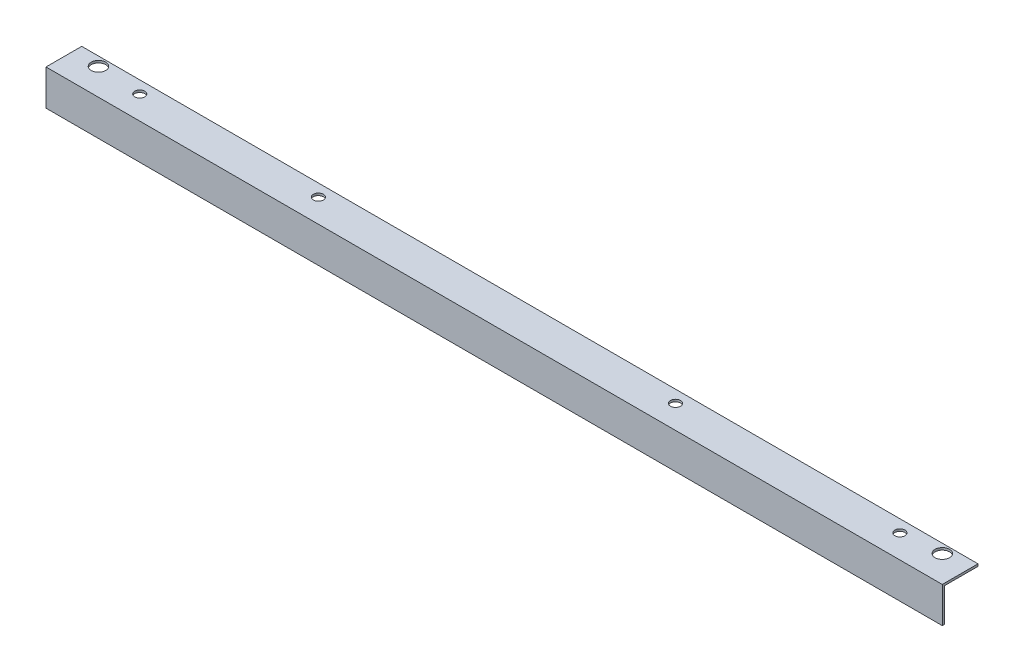
ISO-10303-21;
HEADER;
FILE_DESCRIPTION(('STEP AP214'),'2;1');
FILE_NAME('part.step','',(''),(''),'','','');
FILE_SCHEMA(('AUTOMOTIVE_DESIGN { 1 0 10303 214 1 1 1 1 }'));
ENDSEC;
DATA;
#1=APPLICATION_CONTEXT('core data for automotive mechanical design processes');
#2=APPLICATION_PROTOCOL_DEFINITION('international standard','automotive_design',2000,#1);
#3=PRODUCT_CONTEXT('',#1,'mechanical');
#4=PRODUCT('Part','Part','',(#3));
#5=PRODUCT_RELATED_PRODUCT_CATEGORY('part','',(#4));
#6=PRODUCT_DEFINITION_FORMATION('','',#4);
#7=PRODUCT_DEFINITION_CONTEXT('part definition',#1,'design');
#8=PRODUCT_DEFINITION('design','',#6,#7);
#9=PRODUCT_DEFINITION_SHAPE('','',#8);
#10=(LENGTH_UNIT() NAMED_UNIT(*) SI_UNIT(.MILLI.,.METRE.));
#11=(NAMED_UNIT(*) PLANE_ANGLE_UNIT() SI_UNIT($,.RADIAN.));
#12=(NAMED_UNIT(*) SI_UNIT($,.STERADIAN.) SOLID_ANGLE_UNIT());
#13=UNCERTAINTY_MEASURE_WITH_UNIT(LENGTH_MEASURE(1.E-05),#10,'distance_accuracy_value','');
#14=(GEOMETRIC_REPRESENTATION_CONTEXT(3) GLOBAL_UNCERTAINTY_ASSIGNED_CONTEXT((#13)) GLOBAL_UNIT_ASSIGNED_CONTEXT((#10,
#11,#12)) REPRESENTATION_CONTEXT('',''));
#15=CARTESIAN_POINT('',(0.,0.,0.));
#16=DIRECTION('',(0.,0.,1.));
#17=DIRECTION('',(1.,0.,0.));
#18=AXIS2_PLACEMENT_3D('',#15,#16,#17);
#19=CARTESIAN_POINT('',(599.28125,0.,-38.1));
#20=DIRECTION('',(0.,1.,0.));
#21=DIRECTION('',(0.,0.,1.));
#22=AXIS2_PLACEMENT_3D('',#19,#20,#21);
#23=CYLINDRICAL_SURFACE('',#22,10.31875);
#24=CARTESIAN_POINT('',(599.28125,0.,-38.1));
#25=DIRECTION('',(0.,1.,0.));
#26=DIRECTION('',(0.,0.,1.));
#27=AXIS2_PLACEMENT_3D('',#24,#25,#26);
#28=CIRCLE('',#27,10.31875);
#29=CARTESIAN_POINT('',(599.28125,0.,-27.78125));
#30=VERTEX_POINT('',#29);
#31=EDGE_CURVE('E116',#30,#30,#28,.F.);
#32=ORIENTED_EDGE('',*,*,#31,.F.);
#33=EDGE_LOOP('',(#32));
#34=FACE_BOUND('',#33,.T.);
#35=CARTESIAN_POINT('',(599.28125,-3.175,-38.1));
#36=DIRECTION('',(0.,1.,0.));
#37=DIRECTION('',(0.,0.,1.));
#38=AXIS2_PLACEMENT_3D('',#35,#36,#37);
#39=CIRCLE('',#38,10.31875);
#40=CARTESIAN_POINT('',(599.28125,-3.175,-27.78125));
#41=VERTEX_POINT('',#40);
#42=EDGE_CURVE('E20',#41,#41,#39,.T.);
#43=ORIENTED_EDGE('',*,*,#42,.F.);
#44=EDGE_LOOP('',(#43));
#45=FACE_BOUND('',#44,.T.);
#46=ADVANCED_FACE('F17',(#34,#45),#23,.F.);
#47=CARTESIAN_POINT('',(-600.86875,0.,-38.1));
#48=DIRECTION('',(0.,1.,0.));
#49=DIRECTION('',(0.,0.,1.));
#50=AXIS2_PLACEMENT_3D('',#47,#48,#49);
#51=CYLINDRICAL_SURFACE('',#50,10.31875);
#52=CARTESIAN_POINT('',(-600.86875,0.,-38.1));
#53=DIRECTION('',(0.,1.,0.));
#54=DIRECTION('',(0.,0.,1.));
#55=AXIS2_PLACEMENT_3D('',#52,#53,#54);
#56=CIRCLE('',#55,10.31875);
#57=CARTESIAN_POINT('',(-600.86875,0.,-27.78125));
#58=VERTEX_POINT('',#57);
#59=EDGE_CURVE('E113',#58,#58,#56,.F.);
#60=ORIENTED_EDGE('',*,*,#59,.F.);
#61=EDGE_LOOP('',(#60));
#62=FACE_BOUND('',#61,.T.);
#63=CARTESIAN_POINT('',(-600.86875,-3.175,-38.1));
#64=DIRECTION('',(0.,1.,0.));
#65=DIRECTION('',(0.,0.,1.));
#66=AXIS2_PLACEMENT_3D('',#63,#64,#65);
#67=CIRCLE('',#66,10.31875);
#68=CARTESIAN_POINT('',(-600.86875,-3.175,-27.78125));
#69=VERTEX_POINT('',#68);
#70=EDGE_CURVE('E130',#69,#69,#67,.T.);
#71=ORIENTED_EDGE('',*,*,#70,.F.);
#72=EDGE_LOOP('',(#71));
#73=FACE_BOUND('',#72,.T.);
#74=ADVANCED_FACE('F141',(#62,#73),#51,.F.);
#75=CARTESIAN_POINT('',(543.71875,0.,-33.3375));
#76=DIRECTION('',(0.,1.,0.));
#77=DIRECTION('',(0.,0.,1.));
#78=AXIS2_PLACEMENT_3D('',#75,#76,#77);
#79=CYLINDRICAL_SURFACE('',#78,7.14375);
#80=CARTESIAN_POINT('',(543.71875,0.,-33.3375));
#81=DIRECTION('',(0.,1.,0.));
#82=DIRECTION('',(0.,0.,1.));
#83=AXIS2_PLACEMENT_3D('',#80,#81,#82);
#84=CIRCLE('',#83,7.14375);
#85=CARTESIAN_POINT('',(543.71875,0.,-26.19375));
#86=VERTEX_POINT('',#85);
#87=EDGE_CURVE('E110',#86,#86,#84,.F.);
#88=ORIENTED_EDGE('',*,*,#87,.F.);
#89=EDGE_LOOP('',(#88));
#90=FACE_BOUND('',#89,.T.);
#91=CARTESIAN_POINT('',(543.71875,-3.175,-33.3375));
#92=DIRECTION('',(0.,1.,0.));
#93=DIRECTION('',(0.,0.,1.));
#94=AXIS2_PLACEMENT_3D('',#91,#92,#93);
#95=CIRCLE('',#94,7.14375);
#96=CARTESIAN_POINT('',(543.71875,-3.175,-26.19375));
#97=VERTEX_POINT('',#96);
#98=EDGE_CURVE('E128',#97,#97,#95,.T.);
#99=ORIENTED_EDGE('',*,*,#98,.F.);
#100=EDGE_LOOP('',(#99));
#101=FACE_BOUND('',#100,.T.);
#102=ADVANCED_FACE('F147',(#90,#101),#79,.F.);
#103=CARTESIAN_POINT('',(224.63125,0.,-33.3375));
#104=DIRECTION('',(0.,1.,0.));
#105=DIRECTION('',(0.,0.,1.));
#106=AXIS2_PLACEMENT_3D('',#103,#104,#105);
#107=CYLINDRICAL_SURFACE('',#106,7.14375);
#108=CARTESIAN_POINT('',(224.63125,0.,-33.3375));
#109=DIRECTION('',(0.,1.,0.));
#110=DIRECTION('',(0.,0.,1.));
#111=AXIS2_PLACEMENT_3D('',#108,#109,#110);
#112=CIRCLE('',#111,7.14375);
#113=CARTESIAN_POINT('',(224.63125,0.,-26.19375));
#114=VERTEX_POINT('',#113);
#115=EDGE_CURVE('E107',#114,#114,#112,.F.);
#116=ORIENTED_EDGE('',*,*,#115,.F.);
#117=EDGE_LOOP('',(#116));
#118=FACE_BOUND('',#117,.T.);
#119=CARTESIAN_POINT('',(224.63125,-3.175,-33.3375));
#120=DIRECTION('',(0.,1.,0.));
#121=DIRECTION('',(0.,0.,1.));
#122=AXIS2_PLACEMENT_3D('',#119,#120,#121);
#123=CIRCLE('',#122,7.14375);
#124=CARTESIAN_POINT('',(224.63125,-3.175,-26.19375));
#125=VERTEX_POINT('',#124);
#126=EDGE_CURVE('E125',#125,#125,#123,.T.);
#127=ORIENTED_EDGE('',*,*,#126,.F.);
#128=EDGE_LOOP('',(#127));
#129=FACE_BOUND('',#128,.T.);
#130=ADVANCED_FACE('F186',(#118,#129),#107,.F.);
#131=CARTESIAN_POINT('',(-283.36875,0.,-33.3375));
#132=DIRECTION('',(0.,1.,0.));
#133=DIRECTION('',(0.,0.,1.));
#134=AXIS2_PLACEMENT_3D('',#131,#132,#133);
#135=CYLINDRICAL_SURFACE('',#134,7.14375);
#136=CARTESIAN_POINT('',(-283.36875,0.,-33.3375));
#137=DIRECTION('',(0.,1.,0.));
#138=DIRECTION('',(0.,0.,1.));
#139=AXIS2_PLACEMENT_3D('',#136,#137,#138);
#140=CIRCLE('',#139,7.14375);
#141=CARTESIAN_POINT('',(-283.36875,0.,-26.19375));
#142=VERTEX_POINT('',#141);
#143=EDGE_CURVE('E104',#142,#142,#140,.F.);
#144=ORIENTED_EDGE('',*,*,#143,.F.);
#145=EDGE_LOOP('',(#144));
#146=FACE_BOUND('',#145,.T.);
#147=CARTESIAN_POINT('',(-283.36875,-3.175,-33.3375));
#148=DIRECTION('',(0.,1.,0.));
#149=DIRECTION('',(0.,0.,1.));
#150=AXIS2_PLACEMENT_3D('',#147,#148,#149);
#151=CIRCLE('',#150,7.14375);
#152=CARTESIAN_POINT('',(-283.36875,-3.175,-26.19375));
#153=VERTEX_POINT('',#152);
#154=EDGE_CURVE('E122',#153,#153,#151,.T.);
#155=ORIENTED_EDGE('',*,*,#154,.F.);
#156=EDGE_LOOP('',(#155));
#157=FACE_BOUND('',#156,.T.);
#158=ADVANCED_FACE('F182',(#146,#157),#135,.F.);
#159=CARTESIAN_POINT('',(-537.36875,0.,-33.3375));
#160=DIRECTION('',(0.,1.,0.));
#161=DIRECTION('',(0.,0.,1.));
#162=AXIS2_PLACEMENT_3D('',#159,#160,#161);
#163=CYLINDRICAL_SURFACE('',#162,7.14375);
#164=CARTESIAN_POINT('',(-537.36875,0.,-33.3375));
#165=DIRECTION('',(0.,1.,0.));
#166=DIRECTION('',(0.,0.,1.));
#167=AXIS2_PLACEMENT_3D('',#164,#165,#166);
#168=CIRCLE('',#167,7.14375);
#169=CARTESIAN_POINT('',(-537.36875,0.,-26.19375));
#170=VERTEX_POINT('',#169);
#171=EDGE_CURVE('E101',#170,#170,#168,.F.);
#172=ORIENTED_EDGE('',*,*,#171,.F.);
#173=EDGE_LOOP('',(#172));
#174=FACE_BOUND('',#173,.T.);
#175=CARTESIAN_POINT('',(-537.36875,-3.175,-33.3375));
#176=DIRECTION('',(0.,1.,0.));
#177=DIRECTION('',(0.,0.,1.));
#178=AXIS2_PLACEMENT_3D('',#175,#176,#177);
#179=CIRCLE('',#178,7.14375);
#180=CARTESIAN_POINT('',(-537.36875,-3.175,-26.19375));
#181=VERTEX_POINT('',#180);
#182=EDGE_CURVE('E99',#181,#181,#179,.T.);
#183=ORIENTED_EDGE('',*,*,#182,.F.);
#184=EDGE_LOOP('',(#183));
#185=FACE_BOUND('',#184,.T.);
#186=ADVANCED_FACE('F179',(#174,#185),#163,.F.);
#187=CARTESIAN_POINT('',(-637.38125,-50.8,-3.175));
#188=DIRECTION('',(0.,0.,-1.));
#189=DIRECTION('',(-1.,0.,0.));
#190=AXIS2_PLACEMENT_3D('',#187,#188,#189);
#191=PLANE('',#190);
#192=DIRECTION('',(1.,0.,0.));
#193=VECTOR('',#192,1.);
#194=CARTESIAN_POINT('',(-637.38125,-50.8,-3.175));
#195=LINE('',#194,#193);
#196=CARTESIAN_POINT('',(-637.38125,-50.8,-3.175));
#197=VERTEX_POINT('',#196);
#198=CARTESIAN_POINT('',(637.38125,-50.8,-3.175));
#199=VERTEX_POINT('',#198);
#200=EDGE_CURVE('E73',#197,#199,#195,.T.);
#201=ORIENTED_EDGE('',*,*,#200,.F.);
#202=DIRECTION('',(0.,1.,0.));
#203=VECTOR('',#202,1.);
#204=CARTESIAN_POINT('',(-637.38125,0.,-3.175));
#205=LINE('',#204,#203);
#206=CARTESIAN_POINT('',(-637.38125,-3.175,-3.175));
#207=VERTEX_POINT('',#206);
#208=EDGE_CURVE('E219',#197,#207,#205,.T.);
#209=ORIENTED_EDGE('',*,*,#208,.T.);
#210=DIRECTION('',(1.,0.,0.));
#211=VECTOR('',#210,1.);
#212=CARTESIAN_POINT('',(-637.38125,-3.175,-3.175));
#213=LINE('',#212,#211);
#214=CARTESIAN_POINT('',(637.38125,-3.175,-3.175));
#215=VERTEX_POINT('',#214);
#216=EDGE_CURVE('E68',#215,#207,#213,.F.);
#217=ORIENTED_EDGE('',*,*,#216,.F.);
#218=DIRECTION('',(0.,1.,0.));
#219=VECTOR('',#218,1.);
#220=CARTESIAN_POINT('',(637.38125,0.,-3.175));
#221=LINE('',#220,#219);
#222=EDGE_CURVE('E84',#199,#215,#221,.T.);
#223=ORIENTED_EDGE('',*,*,#222,.F.);
#224=EDGE_LOOP('',(#201,#209,#217,#223));
#225=FACE_BOUND('',#224,.T.);
#226=ADVANCED_FACE('F85',(#225),#191,.T.);
#227=CARTESIAN_POINT('',(-637.38125,-3.175,-3.175));
#228=DIRECTION('',(0.,-1.,0.));
#229=DIRECTION('',(0.,0.,-1.));
#230=AXIS2_PLACEMENT_3D('',#227,#228,#229);
#231=PLANE('',#230);
#232=ORIENTED_EDGE('',*,*,#182,.T.);
#233=EDGE_LOOP('',(#232));
#234=FACE_BOUND('',#233,.T.);
#235=ORIENTED_EDGE('',*,*,#154,.T.);
#236=EDGE_LOOP('',(#235));
#237=FACE_BOUND('',#236,.T.);
#238=ORIENTED_EDGE('',*,*,#126,.T.);
#239=EDGE_LOOP('',(#238));
#240=FACE_BOUND('',#239,.T.);
#241=ORIENTED_EDGE('',*,*,#98,.T.);
#242=EDGE_LOOP('',(#241));
#243=FACE_BOUND('',#242,.T.);
#244=ORIENTED_EDGE('',*,*,#70,.T.);
#245=EDGE_LOOP('',(#244));
#246=FACE_BOUND('',#245,.T.);
#247=ORIENTED_EDGE('',*,*,#42,.T.);
#248=EDGE_LOOP('',(#247));
#249=FACE_BOUND('',#248,.T.);
#250=ORIENTED_EDGE('',*,*,#216,.T.);
#251=DIRECTION('',(0.,0.,-1.));
#252=VECTOR('',#251,1.);
#253=CARTESIAN_POINT('',(-637.38125,-3.175,0.));
#254=LINE('',#253,#252);
#255=CARTESIAN_POINT('',(-637.38125,-3.175,-50.8));
#256=VERTEX_POINT('',#255);
#257=EDGE_CURVE('E214',#207,#256,#254,.T.);
#258=ORIENTED_EDGE('',*,*,#257,.T.);
#259=DIRECTION('',(-1.,0.,0.));
#260=VECTOR('',#259,1.);
#261=CARTESIAN_POINT('',(-637.38125,-3.175,-50.8));
#262=LINE('',#261,#260);
#263=CARTESIAN_POINT('',(637.38125,-3.175,-50.8));
#264=VERTEX_POINT('',#263);
#265=EDGE_CURVE('E81',#264,#256,#262,.T.);
#266=ORIENTED_EDGE('',*,*,#265,.F.);
#267=DIRECTION('',(0.,0.,-1.));
#268=VECTOR('',#267,1.);
#269=CARTESIAN_POINT('',(637.38125,-3.175,0.));
#270=LINE('',#269,#268);
#271=EDGE_CURVE('E88',#215,#264,#270,.T.);
#272=ORIENTED_EDGE('',*,*,#271,.F.);
#273=EDGE_LOOP('',(#250,#258,#266,#272));
#274=FACE_BOUND('',#273,.T.);
#275=ADVANCED_FACE('F137',(#234,#237,#240,#243,#246,#249,#274),#231,.T.);
#276=CARTESIAN_POINT('',(-637.38125,-3.175,-50.8));
#277=DIRECTION('',(0.,0.,-1.));
#278=DIRECTION('',(-1.,0.,0.));
#279=AXIS2_PLACEMENT_3D('',#276,#277,#278);
#280=PLANE('',#279);
#281=ORIENTED_EDGE('',*,*,#265,.T.);
#282=DIRECTION('',(0.,1.,0.));
#283=VECTOR('',#282,1.);
#284=CARTESIAN_POINT('',(-637.38125,0.,-50.8));
#285=LINE('',#284,#283);
#286=CARTESIAN_POINT('',(-637.38125,0.,-50.8));
#287=VERTEX_POINT('',#286);
#288=EDGE_CURVE('E210',#256,#287,#285,.T.);
#289=ORIENTED_EDGE('',*,*,#288,.T.);
#290=DIRECTION('',(1.,0.,0.));
#291=VECTOR('',#290,1.);
#292=CARTESIAN_POINT('',(-637.38125,0.,-50.8));
#293=LINE('',#292,#291);
#294=CARTESIAN_POINT('',(637.38125,0.,-50.8));
#295=VERTEX_POINT('',#294);
#296=EDGE_CURVE('E119',#295,#287,#293,.F.);
#297=ORIENTED_EDGE('',*,*,#296,.F.);
#298=DIRECTION('',(0.,1.,0.));
#299=VECTOR('',#298,1.);
#300=CARTESIAN_POINT('',(637.38125,0.,-50.8));
#301=LINE('',#300,#299);
#302=EDGE_CURVE('E223',#264,#295,#301,.T.);
#303=ORIENTED_EDGE('',*,*,#302,.F.);
#304=EDGE_LOOP('',(#281,#289,#297,#303));
#305=FACE_BOUND('',#304,.T.);
#306=ADVANCED_FACE('F170',(#305),#280,.T.);
#307=CARTESIAN_POINT('',(-637.38125,-50.8,0.));
#308=DIRECTION('',(0.,-1.,0.));
#309=DIRECTION('',(0.,0.,-1.));
#310=AXIS2_PLACEMENT_3D('',#307,#308,#309);
#311=PLANE('',#310);
#312=DIRECTION('',(1.,0.,0.));
#313=VECTOR('',#312,1.);
#314=CARTESIAN_POINT('',(-637.38125,-50.8,0.));
#315=LINE('',#314,#313);
#316=CARTESIAN_POINT('',(-637.38125,-50.8,0.));
#317=VERTEX_POINT('',#316);
#318=CARTESIAN_POINT('',(637.38125,-50.8,0.));
#319=VERTEX_POINT('',#318);
#320=EDGE_CURVE('E211',#317,#319,#315,.T.);
#321=ORIENTED_EDGE('',*,*,#320,.F.);
#322=DIRECTION('',(0.,0.,-1.));
#323=VECTOR('',#322,1.);
#324=CARTESIAN_POINT('',(-637.38125,-50.8,0.));
#325=LINE('',#324,#323);
#326=EDGE_CURVE('E79',#317,#197,#325,.T.);
#327=ORIENTED_EDGE('',*,*,#326,.T.);
#328=ORIENTED_EDGE('',*,*,#200,.T.);
#329=DIRECTION('',(0.,0.,-1.));
#330=VECTOR('',#329,1.);
#331=CARTESIAN_POINT('',(637.38125,-50.8,0.));
#332=LINE('',#331,#330);
#333=EDGE_CURVE('E76',#319,#199,#332,.T.);
#334=ORIENTED_EDGE('',*,*,#333,.F.);
#335=EDGE_LOOP('',(#321,#327,#328,#334));
#336=FACE_BOUND('',#335,.T.);
#337=ADVANCED_FACE('F74',(#336),#311,.T.);
#338=CARTESIAN_POINT('',(637.38125,0.,0.));
#339=DIRECTION('',(1.,0.,0.));
#340=DIRECTION('',(0.,0.,-1.));
#341=AXIS2_PLACEMENT_3D('',#338,#339,#340);
#342=PLANE('',#341);
#343=DIRECTION('',(0.,0.,1.));
#344=VECTOR('',#343,1.);
#345=CARTESIAN_POINT('',(637.38125,0.,-50.8));
#346=LINE('',#345,#344);
#347=CARTESIAN_POINT('',(637.38125,0.,0.));
#348=VERTEX_POINT('',#347);
#349=EDGE_CURVE('E205',#348,#295,#346,.F.);
#350=ORIENTED_EDGE('',*,*,#349,.F.);
#351=DIRECTION('',(0.,1.,0.));
#352=VECTOR('',#351,1.);
#353=CARTESIAN_POINT('',(637.38125,0.,0.));
#354=LINE('',#353,#352);
#355=EDGE_CURVE('E92',#319,#348,#354,.T.);
#356=ORIENTED_EDGE('',*,*,#355,.F.);
#357=ORIENTED_EDGE('',*,*,#333,.T.);
#358=ORIENTED_EDGE('',*,*,#222,.T.);
#359=ORIENTED_EDGE('',*,*,#271,.T.);
#360=ORIENTED_EDGE('',*,*,#302,.T.);
#361=EDGE_LOOP('',(#350,#356,#357,#358,#359,#360));
#362=FACE_BOUND('',#361,.T.);
#363=ADVANCED_FACE('F90',(#362),#342,.T.);
#364=CARTESIAN_POINT('',(-637.38125,0.,-50.8));
#365=DIRECTION('',(0.,1.,0.));
#366=DIRECTION('',(0.,0.,1.));
#367=AXIS2_PLACEMENT_3D('',#364,#365,#366);
#368=PLANE('',#367);
#369=ORIENTED_EDGE('',*,*,#171,.T.);
#370=EDGE_LOOP('',(#369));
#371=FACE_BOUND('',#370,.T.);
#372=ORIENTED_EDGE('',*,*,#143,.T.);
#373=EDGE_LOOP('',(#372));
#374=FACE_BOUND('',#373,.T.);
#375=ORIENTED_EDGE('',*,*,#115,.T.);
#376=EDGE_LOOP('',(#375));
#377=FACE_BOUND('',#376,.T.);
#378=ORIENTED_EDGE('',*,*,#87,.T.);
#379=EDGE_LOOP('',(#378));
#380=FACE_BOUND('',#379,.T.);
#381=ORIENTED_EDGE('',*,*,#59,.T.);
#382=EDGE_LOOP('',(#381));
#383=FACE_BOUND('',#382,.T.);
#384=ORIENTED_EDGE('',*,*,#31,.T.);
#385=EDGE_LOOP('',(#384));
#386=FACE_BOUND('',#385,.T.);
#387=ORIENTED_EDGE('',*,*,#296,.T.);
#388=DIRECTION('',(0.,0.,-1.));
#389=VECTOR('',#388,1.);
#390=CARTESIAN_POINT('',(-637.38125,0.,0.));
#391=LINE('',#390,#389);
#392=CARTESIAN_POINT('',(-637.38125,0.,0.));
#393=VERTEX_POINT('',#392);
#394=EDGE_CURVE('E35',#287,#393,#391,.F.);
#395=ORIENTED_EDGE('',*,*,#394,.T.);
#396=DIRECTION('',(1.,0.,0.));
#397=VECTOR('',#396,1.);
#398=CARTESIAN_POINT('',(-637.38125,0.,0.));
#399=LINE('',#398,#397);
#400=EDGE_CURVE('E26',#348,#393,#399,.F.);
#401=ORIENTED_EDGE('',*,*,#400,.F.);
#402=ORIENTED_EDGE('',*,*,#349,.T.);
#403=EDGE_LOOP('',(#387,#395,#401,#402));
#404=FACE_BOUND('',#403,.T.);
#405=ADVANCED_FACE('F158',(#371,#374,#377,#380,#383,#386,#404),#368,.T.);
#406=CARTESIAN_POINT('',(-637.38125,0.,0.));
#407=DIRECTION('',(1.,0.,0.));
#408=DIRECTION('',(0.,0.,-1.));
#409=AXIS2_PLACEMENT_3D('',#406,#407,#408);
#410=PLANE('',#409);
#411=ORIENTED_EDGE('',*,*,#288,.F.);
#412=ORIENTED_EDGE('',*,*,#257,.F.);
#413=ORIENTED_EDGE('',*,*,#208,.F.);
#414=ORIENTED_EDGE('',*,*,#326,.F.);
#415=DIRECTION('',(0.,1.,0.));
#416=VECTOR('',#415,1.);
#417=CARTESIAN_POINT('',(-637.38125,0.,0.));
#418=LINE('',#417,#416);
#419=EDGE_CURVE('E11',#393,#317,#418,.F.);
#420=ORIENTED_EDGE('',*,*,#419,.F.);
#421=ORIENTED_EDGE('',*,*,#394,.F.);
#422=EDGE_LOOP('',(#411,#412,#413,#414,#420,#421));
#423=FACE_BOUND('',#422,.T.);
#424=ADVANCED_FACE('F152',(#423),#410,.F.);
#425=CARTESIAN_POINT('',(-637.38125,0.,0.));
#426=DIRECTION('',(0.,0.,1.));
#427=DIRECTION('',(1.,0.,0.));
#428=AXIS2_PLACEMENT_3D('',#425,#426,#427);
#429=PLANE('',#428);
#430=ORIENTED_EDGE('',*,*,#400,.T.);
#431=ORIENTED_EDGE('',*,*,#419,.T.);
#432=ORIENTED_EDGE('',*,*,#320,.T.);
#433=ORIENTED_EDGE('',*,*,#355,.T.);
#434=EDGE_LOOP('',(#430,#431,#432,#433));
#435=FACE_BOUND('',#434,.T.);
#436=ADVANCED_FACE('F150',(#435),#429,.T.);
#437=CLOSED_SHELL('',(#46,#74,#102,#130,#158,#186,#226,#275,#306,#337,#363,#405,#424,#436));
#438=MANIFOLD_SOLID_BREP('B1',#437);
#439=ADVANCED_BREP_SHAPE_REPRESENTATION('',(#18,#438),#14);
#440=SHAPE_DEFINITION_REPRESENTATION(#9,#439);
ENDSEC;
END-ISO-10303-21;
